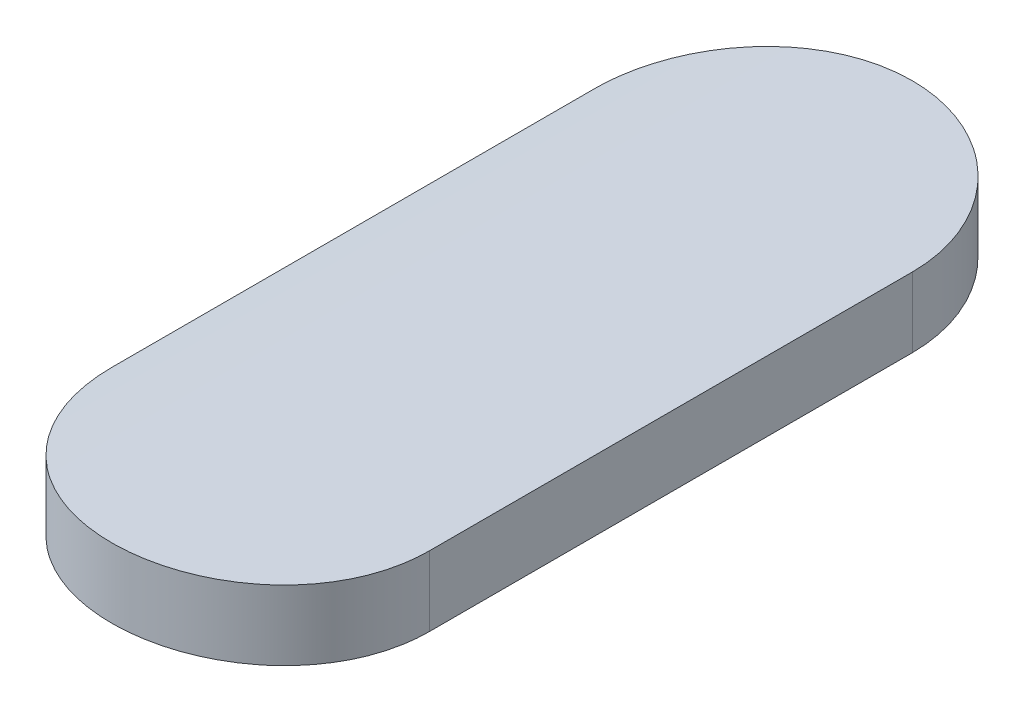
ISO-10303-21;
HEADER;
FILE_DESCRIPTION(('STEP AP214'),'2;1');
FILE_NAME('part.step','',(''),(''),'','','');
FILE_SCHEMA(('AUTOMOTIVE_DESIGN { 1 0 10303 214 1 1 1 1 }'));
ENDSEC;
DATA;
#1=APPLICATION_CONTEXT('core data for automotive mechanical design processes');
#2=APPLICATION_PROTOCOL_DEFINITION('international standard','automotive_design',2000,#1);
#3=PRODUCT_CONTEXT('',#1,'mechanical');
#4=PRODUCT('Part','Part','',(#3));
#5=PRODUCT_RELATED_PRODUCT_CATEGORY('part','',(#4));
#6=PRODUCT_DEFINITION_FORMATION('','',#4);
#7=PRODUCT_DEFINITION_CONTEXT('part definition',#1,'design');
#8=PRODUCT_DEFINITION('design','',#6,#7);
#9=PRODUCT_DEFINITION_SHAPE('','',#8);
#10=(LENGTH_UNIT() NAMED_UNIT(*) SI_UNIT(.MILLI.,.METRE.));
#11=(NAMED_UNIT(*) PLANE_ANGLE_UNIT() SI_UNIT($,.RADIAN.));
#12=(NAMED_UNIT(*) SI_UNIT($,.STERADIAN.) SOLID_ANGLE_UNIT());
#13=UNCERTAINTY_MEASURE_WITH_UNIT(LENGTH_MEASURE(1.E-05),#10,'distance_accuracy_value','');
#14=(GEOMETRIC_REPRESENTATION_CONTEXT(3) GLOBAL_UNCERTAINTY_ASSIGNED_CONTEXT((#13)) GLOBAL_UNIT_ASSIGNED_CONTEXT((#10,
#11,#12)) REPRESENTATION_CONTEXT('',''));
#15=CARTESIAN_POINT('',(0.,0.,0.));
#16=DIRECTION('',(0.,0.,1.));
#17=DIRECTION('',(1.,0.,0.));
#18=AXIS2_PLACEMENT_3D('',#15,#16,#17);
#19=CARTESIAN_POINT('',(-102.183303397109,-58.0021041199526,0.810125243112793));
#20=DIRECTION('',(0.,0.,1.));
#21=DIRECTION('',(1.,0.,0.));
#22=AXIS2_PLACEMENT_3D('',#19,#20,#21);
#23=CYLINDRICAL_SURFACE('',#22,3.03);
#24=DIRECTION('',(0.,0.,-1.));
#25=VECTOR('',#24,1.);
#26=CARTESIAN_POINT('',(-102.456886969413,-54.9844805468465,-0.418890375643386));
#27=LINE('',#26,#25);
#28=CARTESIAN_POINT('',(-102.456886969413,-54.9844805468465,-0.418890375643386));
#29=VERTEX_POINT('',#28);
#30=CARTESIAN_POINT('',(-102.456886969413,-54.9844805468465,-1.25058443544607));
#31=VERTEX_POINT('',#30);
#32=EDGE_CURVE('E63',#29,#31,#27,.T.);
#33=ORIENTED_EDGE('',*,*,#32,.T.);
#34=CARTESIAN_POINT('',(-101.909719824805,-54.9844805468465,-1.25058443544607));
#35=CARTESIAN_POINT('',(-101.909706605658,-54.9844850850065,-1.26594230880644));
#36=CARTESIAN_POINT('',(-101.911012210473,-54.9843634291541,-1.28129556968977));
#37=CARTESIAN_POINT('',(-101.916162756661,-54.9839013638385,-1.31155313436541));
#38=CARTESIAN_POINT('',(-101.920005406143,-54.9835611518201,-1.32645783068304));
#39=CARTESIAN_POINT('',(-101.930134044468,-54.982695325965,-1.35541346846418));
#40=CARTESIAN_POINT('',(-101.936420992914,-54.9821696393207,-1.36946407211287));
#41=CARTESIAN_POINT('',(-101.951253172458,-54.9809936958497,-1.3963090716143));
#42=CARTESIAN_POINT('',(-101.959798099861,-54.9803434557786,-1.40910363608506));
#43=CARTESIAN_POINT('',(-101.978931274905,-54.9789891929714,-1.43311185884462));
#44=CARTESIAN_POINT('',(-101.989524705438,-54.9782850366116,-1.4443213795828));
#45=CARTESIAN_POINT('',(-102.01244423575,-54.976903511139,-1.46480719554307));
#46=CARTESIAN_POINT('',(-102.024770598873,-54.9762261461177,-1.47408319640817));
#47=CARTESIAN_POINT('',(-102.050830830711,-54.9749732653347,-1.49045136433822));
#48=CARTESIAN_POINT('',(-102.064567028138,-54.9743979225072,-1.49753983817727));
#49=CARTESIAN_POINT('',(-102.093039900517,-54.9734154280022,-1.50930772549852));
#50=CARTESIAN_POINT('',(-102.107776494586,-54.9730082627462,-1.51398733347563));
#51=CARTESIAN_POINT('',(-102.137789954603,-54.9724089065577,-1.52079293233044));
#52=CARTESIAN_POINT('',(-102.153065236644,-54.9722161320768,-1.52292585617692));
#53=CARTESIAN_POINT('',(-102.18375848949,-54.9720652956585,-1.52459899115631));
#54=CARTESIAN_POINT('',(-102.199176460722,-54.972107234425,-1.52413919451433));
#55=CARTESIAN_POINT('',(-102.229669558058,-54.9724206277345,-1.52064550122751));
#56=CARTESIAN_POINT('',(-102.244745554765,-54.9726914108666,-1.51761913460157));
#57=CARTESIAN_POINT('',(-102.274174660857,-54.9734312715637,-1.50908994007883));
#58=CARTESIAN_POINT('',(-102.288527765871,-54.9739003503275,-1.50358709721214));
#59=CARTESIAN_POINT('',(-102.316127881446,-54.9749852107613,-1.49025268635527));
#60=CARTESIAN_POINT('',(-102.329373238902,-54.9756012065815,-1.48241771482055));
#61=CARTESIAN_POINT('',(-102.354363137426,-54.9769106737635,-1.46464431848637));
#62=CARTESIAN_POINT('',(-102.366107710778,-54.9776041434581,-1.45470593894639));
#63=CARTESIAN_POINT('',(-102.387805918562,-54.9789935419706,-1.43296688073388));
#64=CARTESIAN_POINT('',(-102.397753257335,-54.9796894710466,-1.42115991733832));
#65=CARTESIAN_POINT('',(-102.41552860711,-54.9810031213351,-1.3960362716264));
#66=CARTESIAN_POINT('',(-102.423355968339,-54.9816208185386,-1.3827191282106));
#67=CARTESIAN_POINT('',(-102.43666961025,-54.9827084570825,-1.35494453696834));
#68=CARTESIAN_POINT('',(-102.44215412786,-54.9831782870781,-1.34048624004393));
#69=CARTESIAN_POINT('',(-102.45060539616,-54.9839144740036,-1.31086648875095));
#70=CARTESIAN_POINT('',(-102.453575961733,-54.9841811391716,-1.29570613675035));
#71=CARTESIAN_POINT('',(-102.45634450532,-54.9844315961996,-1.27050475649965));
#72=CARTESIAN_POINT('',(-102.456891551668,-54.9844819522347,-1.26054212270751));
#73=CARTESIAN_POINT('',(-102.456886969413,-54.9844805468465,-1.25058443544607));
#74=B_SPLINE_CURVE_WITH_KNOTS('',3,(#34,#35,#36,#37,#38,#39,#40,#41,#42,#43,#44,#45,#46,#47,#48,
#49,#50,#51,#52,#53,#54,#55,#56,#57,#58,#59,#60,#61,#62,#63,#64,#65,#66,#67,#68,#69,#70,#71,#72,
#73),.UNSPECIFIED.,.F.,.F.,(4,2,2,2,2,2,2,2,2,2,2,2,2,2,2,2,2,2,2,4),(0.,0.0460110092394254,
0.0919805102672427,0.137968076626718,0.183949460880802,0.230048741249604,0.276155034605764,
0.322338749161009,0.368518734199195,0.4145727123466,0.460626828597775,0.506546292990871,
0.552466034963503,0.598453124267928,0.64443922415896,0.690583414231287,0.736741731520304,
0.782934723603295,0.829057492186304,0.858928716261802),.UNSPECIFIED.);
#75=CARTESIAN_POINT('',(-101.909719824806,-54.9844805468465,-1.25058443544607));
#76=VERTEX_POINT('',#75);
#77=EDGE_CURVE('E21',#76,#31,#74,.T.);
#78=ORIENTED_EDGE('',*,*,#77,.F.);
#79=DIRECTION('',(0.,0.,1.));
#80=VECTOR('',#79,1.);
#81=CARTESIAN_POINT('',(-101.909719824806,-54.9844805468465,-1.25058443544607));
#82=LINE('',#81,#80);
#83=CARTESIAN_POINT('',(-101.909719824806,-54.9844805468465,-0.418890375643386));
#84=VERTEX_POINT('',#83);
#85=EDGE_CURVE('E60',#76,#84,#82,.T.);
#86=ORIENTED_EDGE('',*,*,#85,.T.);
#87=CARTESIAN_POINT('',(-102.456886969413,-54.9844805468465,-0.418890375643386));
#88=CARTESIAN_POINT('',(-102.456900190607,-54.9844850849377,-0.403532552212933));
#89=CARTESIAN_POINT('',(-102.455594593258,-54.9843634299103,-0.388179341133129));
#90=CARTESIAN_POINT('',(-102.450444061444,-54.9839013660614,-0.357921773656045));
#91=CARTESIAN_POINT('',(-102.446601402425,-54.983561153268,-0.343017027551366));
#92=CARTESIAN_POINT('',(-102.436472642403,-54.9826953165674,-0.314061029618398));
#93=CARTESIAN_POINT('',(-102.430185536937,-54.9821696164489,-0.300010131397706));
#94=CARTESIAN_POINT('',(-102.41535324315,-54.9809936677021,-0.273165183244441));
#95=CARTESIAN_POINT('',(-102.406808456113,-54.980343441213,-0.260370910510878));
#96=CARTESIAN_POINT('',(-102.387676631922,-54.9789892694197,-0.236364313803236));
#97=CARTESIAN_POINT('',(-102.377084597454,-54.9782851952686,-0.225155979483312));
#98=CARTESIAN_POINT('',(-102.354165239255,-54.9769036653171,-0.204669706015482));
#99=CARTESIAN_POINT('',(-102.341837261432,-54.9762262196739,-0.195392497784914));
#100=CARTESIAN_POINT('',(-102.315769264304,-54.9749729209117,-0.179019025092981));
#101=CARTESIAN_POINT('',(-102.302026318173,-54.9743972853461,-0.171927407488309));
#102=CARTESIAN_POINT('',(-102.27354921626,-54.9734149909817,-0.16016178696441));
#103=CARTESIAN_POINT('',(-102.258816238366,-54.9730081353731,-0.155484966646577));
#104=CARTESIAN_POINT('',(-102.233886053535,-54.972510035285,-0.149830883428783));
#105=CARTESIAN_POINT('',(-102.223846782162,-54.972358537245,-0.148136700735683));
#106=CARTESIAN_POINT('',(-102.203640939076,-54.9721555261584,-0.145874433100257));
#107=CARTESIAN_POINT('',(-102.193474365172,-54.9721040148336,-0.145306367549251));
#108=CARTESIAN_POINT('',(-102.167968999569,-54.9721042784367,-0.145307460365492));
#109=CARTESIAN_POINT('',(-102.152624613888,-54.9722217636421,-0.146600348966459));
#110=CARTESIAN_POINT('',(-102.122361359423,-54.9726791209169,-0.151738551797835));
#111=CARTESIAN_POINT('',(-102.107442963411,-54.9730192307578,-0.155586595094576));
#112=CARTESIAN_POINT('',(-102.078473534918,-54.9738834186235,-0.165722568118504));
#113=CARTESIAN_POINT('',(-102.064422014796,-54.97440739209,-0.1720091113495));
#114=CARTESIAN_POINT('',(-102.037576476559,-54.9755806299851,-0.186841237701006));
#115=CARTESIAN_POINT('',(-102.024782230313,-54.9762298716205,-0.195386409955503));
#116=CARTESIAN_POINT('',(-102.000774094236,-54.9775829614183,-0.21451998728212));
#117=CARTESIAN_POINT('',(-101.989564399305,-54.9782869471526,-0.225113646368365));
#118=CARTESIAN_POINT('',(-101.969079070535,-54.9796690712488,-0.248033302183883));
#119=CARTESIAN_POINT('',(-101.959803597104,-54.980347207463,-0.260359442448896));
#120=CARTESIAN_POINT('',(-101.943434148177,-54.9816024211497,-0.286421291886513));
#121=CARTESIAN_POINT('',(-101.936344485946,-54.9821792978532,-0.300159717626489));
#122=CARTESIAN_POINT('',(-101.924577378013,-54.9831645823514,-0.328636259658781));
#123=CARTESIAN_POINT('',(-101.919898629531,-54.9835730811081,-0.343373831162475));
#124=CARTESIAN_POINT('',(-101.914242216141,-54.984073110083,-0.368315743955098));
#125=CARTESIAN_POINT('',(-101.91254746587,-54.9842251554516,-0.37836211292653));
#126=CARTESIAN_POINT('',(-101.910286357103,-54.9844291774748,-0.398567675569197));
#127=CARTESIAN_POINT('',(-101.909718414401,-54.9844812946176,-0.408726690618611));
#128=CARTESIAN_POINT('',(-101.909719824805,-54.9844805468465,-0.418890375643388));
#129=B_SPLINE_CURVE_WITH_KNOTS('',3,(#87,#88,#89,#90,#91,#92,#93,#94,#95,#96,#97,#98,#99,#100,
#101,#102,#103,#104,#105,#106,#107,#108,#109,#110,#111,#112,#113,#114,#115,#116,#117,#118,#119,
#120,#121,#122,#123,#124,#125,#126,#127,#128),.UNSPECIFIED.,.F.,.F.,(4,2,2,2,2,2,2,2,2,2,2,2,2,
2,2,2,2,2,2,2,4),(0.,0.0460108603236396,0.0919805102691056,0.137969069867937,0.183949460872781,
0.230043540383735,0.27615503457662,0.32236390216454,0.368518734300648,0.39900650752063,
0.429494805724201,0.475460900795541,0.521476169693522,0.567465313228819,0.613446096654045,
0.659546415719329,0.705650556441166,0.751845100716589,0.798014656700611,0.828523596054447,
0.858989611669695),.UNSPECIFIED.);
#130=EDGE_CURVE('E77',#29,#84,#129,.T.);
#131=ORIENTED_EDGE('',*,*,#130,.F.);
#132=EDGE_LOOP('',(#33,#78,#86,#131));
#133=FACE_BOUND('',#132,.T.);
#134=ADVANCED_FACE('F17',(#133),#23,.F.);
#135=CARTESIAN_POINT('',(-102.183303397109,-53.4571041199525,-1.25058443544607));
#136=DIRECTION('',(0.,1.,0.));
#137=DIRECTION('',(0.,0.,1.));
#138=AXIS2_PLACEMENT_3D('',#135,#136,#137);
#139=CYLINDRICAL_SURFACE('',#138,0.273583572303522);
#140=DIRECTION('',(0.,1.,0.));
#141=VECTOR('',#140,1.);
#142=CARTESIAN_POINT('',(-101.909719824806,-53.4571041199525,-1.25058443544607));
#143=LINE('',#142,#141);
#144=CARTESIAN_POINT('',(-101.909719824806,-54.8640072398411,-1.25058443544607));
#145=VERTEX_POINT('',#144);
#146=EDGE_CURVE('E67',#145,#76,#143,.F.);
#147=ORIENTED_EDGE('',*,*,#146,.T.);
#148=ORIENTED_EDGE('',*,*,#77,.T.);
#149=DIRECTION('',(0.,1.,0.));
#150=VECTOR('',#149,1.);
#151=CARTESIAN_POINT('',(-102.456886969413,-53.4571041199525,-1.25058443544607));
#152=LINE('',#151,#150);
#153=CARTESIAN_POINT('',(-102.456886969413,-54.8640072398411,-1.25058443544607));
#154=VERTEX_POINT('',#153);
#155=EDGE_CURVE('E83',#31,#154,#152,.T.);
#156=ORIENTED_EDGE('',*,*,#155,.T.);
#157=CARTESIAN_POINT('',(-101.909719824805,-54.8640072398411,-1.25058443544607));
#158=CARTESIAN_POINT('',(-101.909706616778,-54.8640116038495,-1.26594478271644));
#159=CARTESIAN_POINT('',(-101.911012629097,-54.8638945821352,-1.28130057070052));
#160=CARTESIAN_POINT('',(-101.91616493209,-54.8634501023721,-1.31156339478972));
#161=CARTESIAN_POINT('',(-101.92000896244,-54.8631228315755,-1.3264708178627));
#162=CARTESIAN_POINT('',(-101.930141476108,-54.8622899162493,-1.35543188296314));
#163=CARTESIAN_POINT('',(-101.936430932495,-54.8617842007215,-1.36948518254575));
#164=CARTESIAN_POINT('',(-101.951269236735,-54.8606529156442,-1.39633502259704));
#165=CARTESIAN_POINT('',(-101.959817770308,-54.8600273627696,-1.40913173754066));
#166=CARTESIAN_POINT('',(-101.978957254186,-54.858724650616,-1.43314102137832));
#167=CARTESIAN_POINT('',(-101.989553004558,-54.85804737236,-1.44434975776107));
#168=CARTESIAN_POINT('',(-102.012477047229,-54.8567186189181,-1.46483343030569));
#169=CARTESIAN_POINT('',(-102.024805602851,-54.8560671476734,-1.47410807202307));
#170=CARTESIAN_POINT('',(-102.050868037135,-54.8548623045616,-1.49047183073304));
#171=CARTESIAN_POINT('',(-102.064604063545,-54.854309086249,-1.49755753931129));
#172=CARTESIAN_POINT('',(-102.093075660351,-54.8533644337177,-1.50932010491488));
#173=CARTESIAN_POINT('',(-102.107811151204,-54.8529729866417,-1.51399715338457));
#174=CARTESIAN_POINT('',(-102.13782470229,-54.8523967862496,-1.52079885058031));
#175=CARTESIAN_POINT('',(-102.153101299041,-54.8522115136778,-1.52292991244132));
#176=CARTESIAN_POINT('',(-102.1837967687,-54.8520667749048,-1.52459898234392));
#177=CARTESIAN_POINT('',(-102.199215642245,-54.8521073097163,-1.52413697875463));
#178=CARTESIAN_POINT('',(-102.229713640967,-54.8524091989506,-1.52063817722405));
#179=CARTESIAN_POINT('',(-102.244793572653,-54.8526699554928,-1.51760835059442));
#180=CARTESIAN_POINT('',(-102.274229971334,-54.8533822737681,-1.50907076618021));
#181=CARTESIAN_POINT('',(-102.288586434427,-54.8538338365303,-1.50356299503172));
#182=CARTESIAN_POINT('',(-102.31619086392,-54.8548780121511,-1.49021799056072));
#183=CARTESIAN_POINT('',(-102.3294372941,-54.8554708162598,-1.48237759509875));
#184=CARTESIAN_POINT('',(-102.354428176498,-54.8567308333417,-1.46459259521596));
#185=CARTESIAN_POINT('',(-102.366172664124,-54.8573980445601,-1.45464804041298));
#186=CARTESIAN_POINT('',(-102.387866258427,-54.8587344683245,-1.43289918453586));
#187=CARTESIAN_POINT('',(-102.397809554026,-54.8594036805078,-1.4210890863643));
#188=CARTESIAN_POINT('',(-102.415576264114,-54.8606667104951,-1.39596012249329));
#189=CARTESIAN_POINT('',(-102.423399026913,-54.8612605050917,-1.38264079475134));
#190=CARTESIAN_POINT('',(-102.436703008999,-54.8623058530949,-1.35486328492659));
#191=CARTESIAN_POINT('',(-102.442182501874,-54.8627573015633,-1.34040427243347));
#192=CARTESIAN_POINT('',(-102.450623831935,-54.863464474176,-1.31078436642828));
#193=CARTESIAN_POINT('',(-102.453589485952,-54.8637204949845,-1.29562457397317));
#194=CARTESIAN_POINT('',(-102.456347444913,-54.8639604241394,-1.27045076145606));
#195=CARTESIAN_POINT('',(-102.456891513284,-54.8640085803269,-1.26051511984833));
#196=CARTESIAN_POINT('',(-102.456886969413,-54.8640072398411,-1.25058443544607));
#197=B_SPLINE_CURVE_WITH_KNOTS('',3,(#157,#158,#159,#160,#161,#162,#163,#164,#165,#166,#167,
#168,#169,#170,#171,#172,#173,#174,#175,#176,#177,#178,#179,#180,#181,#182,#183,#184,#185,#186,
#187,#188,#189,#190,#191,#192,#193,#194,#195,#196),.UNSPECIFIED.,.F.,.F.,(4,2,2,2,2,2,2,2,2,2,2,
2,2,2,2,2,2,2,2,4),(0.,0.046018526994018,0.0919961256717346,0.137992038231912,0.183981555270105,
0.230080241017504,0.276185939663917,0.322363072340193,0.368536534213797,0.414593441972155,
0.460650556313085,0.506583030539249,0.552515752488997,0.598511027446195,0.644505217917076,
0.690645251790533,0.736799449546967,0.782987593228124,0.829105481902434,0.858895844339731),.UNSPECIFIED.);
#198=EDGE_CURVE('E70',#145,#154,#197,.T.);
#199=ORIENTED_EDGE('',*,*,#198,.F.);
#200=EDGE_LOOP('',(#147,#148,#156,#199));
#201=FACE_BOUND('',#200,.T.);
#202=ADVANCED_FACE('F68',(#201),#139,.T.);
#203=CARTESIAN_POINT('',(-102.456886969413,-53.4571041199525,-0.418890375643386));
#204=DIRECTION('',(1.,0.,0.));
#205=DIRECTION('',(0.,0.,-1.));
#206=AXIS2_PLACEMENT_3D('',#203,#204,#205);
#207=PLANE('',#206);
#208=DIRECTION('',(0.,0.,1.));
#209=VECTOR('',#208,1.);
#210=CARTESIAN_POINT('',(-102.456886969413,-54.8640072398411,0.810125243112793));
#211=LINE('',#210,#209);
#212=CARTESIAN_POINT('',(-102.456886969413,-54.8640072398411,-0.418890375643386));
#213=VERTEX_POINT('',#212);
#214=EDGE_CURVE('E92',#154,#213,#211,.T.);
#215=ORIENTED_EDGE('',*,*,#214,.F.);
#216=ORIENTED_EDGE('',*,*,#155,.F.);
#217=ORIENTED_EDGE('',*,*,#32,.F.);
#218=DIRECTION('',(0.,1.,0.));
#219=VECTOR('',#218,1.);
#220=CARTESIAN_POINT('',(-102.456886969413,-53.4571041199525,-0.418890375643386));
#221=LINE('',#220,#219);
#222=EDGE_CURVE('E80',#213,#29,#221,.F.);
#223=ORIENTED_EDGE('',*,*,#222,.F.);
#224=EDGE_LOOP('',(#215,#216,#217,#223));
#225=FACE_BOUND('',#224,.T.);
#226=ADVANCED_FACE('F103',(#225),#207,.F.);
#227=CARTESIAN_POINT('',(-102.183303397109,-53.4571041199525,-0.418890375643386));
#228=DIRECTION('',(0.,1.,0.));
#229=DIRECTION('',(0.,0.,1.));
#230=AXIS2_PLACEMENT_3D('',#227,#228,#229);
#231=CYLINDRICAL_SURFACE('',#230,0.273583572303515);
#232=DIRECTION('',(0.,1.,0.));
#233=VECTOR('',#232,1.);
#234=CARTESIAN_POINT('',(-101.909719824806,-53.4571041199525,-0.418890375643386));
#235=LINE('',#234,#233);
#236=CARTESIAN_POINT('',(-101.909719824806,-54.8640072398411,-0.418890375643386));
#237=VERTEX_POINT('',#236);
#238=EDGE_CURVE('E73',#84,#237,#235,.T.);
#239=ORIENTED_EDGE('',*,*,#238,.T.);
#240=CARTESIAN_POINT('',(-102.456886969413,-54.8640072398411,-0.418890375643386));
#241=CARTESIAN_POINT('',(-102.456900179489,-54.8640116037829,-0.403530078771605));
#242=CARTESIAN_POINT('',(-102.455594174716,-54.8638945828694,-0.388174341058224));
#243=CARTESIAN_POINT('',(-102.450441886252,-54.86345010453,-0.357911514141355));
#244=CARTESIAN_POINT('',(-102.446597846284,-54.8631228329808,-0.343004040813818));
#245=CARTESIAN_POINT('',(-102.436465210489,-54.8622899071895,-0.314042614390904));
#246=CARTESIAN_POINT('',(-102.430175596673,-54.8617841786715,-0.299989019549287));
#247=CARTESIAN_POINT('',(-102.415337177917,-54.8606528885075,-0.273139230980292));
#248=CARTESIAN_POINT('',(-102.406788785105,-54.8600273487274,-0.260342808458379));
#249=CARTESIAN_POINT('',(-102.38765065439,-54.8587247242468,-0.236335153048577));
#250=CARTESIAN_POINT('',(-102.377056302192,-54.8580475251671,-0.225127604579873));
#251=CARTESIAN_POINT('',(-102.354132431993,-54.8567187674053,-0.204643473796036));
#252=CARTESIAN_POINT('',(-102.341802259417,-54.8560672185151,-0.195367623208403));
#253=CARTESIAN_POINT('',(-102.315732052178,-54.8548619730904,-0.178998556591857));
#254=CARTESIAN_POINT('',(-102.301989271481,-54.8543084730681,-0.171909703186659));
#255=CARTESIAN_POINT('',(-102.273513443909,-54.853364013255,-0.160149406131124));
#256=CARTESIAN_POINT('',(-102.258781573432,-54.8529728642116,-0.155475146221719));
#257=CARTESIAN_POINT('',(-102.2338580441,-54.8524941369114,-0.149825830236814));
#258=CARTESIAN_POINT('',(-102.223824202065,-54.8523485718543,-0.148133533833658));
#259=CARTESIAN_POINT('',(-102.203629505257,-54.8521535119536,-0.145873792851279));
#260=CARTESIAN_POINT('',(-102.193468648264,-54.8521040187922,-0.145306367969359));
#261=CARTESIAN_POINT('',(-102.16796643803,-54.8521042725794,-0.145307460207253));
#262=CARTESIAN_POINT('',(-102.152619476227,-54.8522173200861,-0.146600775441735));
#263=CARTESIAN_POINT('',(-102.122351022129,-54.8526574002586,-0.151740753874226));
#264=CARTESIAN_POINT('',(-102.107430003153,-54.852984661991,-0.155590150441056));
#265=CARTESIAN_POINT('',(-102.078455291,-54.8538161955517,-0.165729930778515));
#266=CARTESIAN_POINT('',(-102.064401118331,-54.8543203684713,-0.172018950794233));
#267=CARTESIAN_POINT('',(-102.03755077825,-54.855449232041,-0.186857144754768));
#268=CARTESIAN_POINT('',(-102.02475438013,-54.8560739005266,-0.195405903140214));
#269=CARTESIAN_POINT('',(-102.000745145557,-54.8573755748558,-0.214545773806812));
#270=CARTESIAN_POINT('',(-101.989536202558,-54.8580527032867,-0.225141761850879));
#271=CARTESIAN_POINT('',(-101.969052960131,-54.8593819911154,-0.248065956292792));
#272=CARTESIAN_POINT('',(-101.959778820157,-54.8600341484516,-0.260394305320696));
#273=CARTESIAN_POINT('',(-101.943413755972,-54.8612410770389,-0.286458365998949));
#274=CARTESIAN_POINT('',(-101.936326854895,-54.8617956680339,-0.300196609864991));
#275=CARTESIAN_POINT('',(-101.924565054023,-54.8627427988405,-0.328671865001971));
#276=CARTESIAN_POINT('',(-101.919888856196,-54.8631354258381,-0.343408333936013));
#277=CARTESIAN_POINT('',(-101.914237180344,-54.8636158769288,-0.368343649454978));
#278=CARTESIAN_POINT('',(-101.912544302614,-54.8637619262361,-0.378384645101069));
#279=CARTESIAN_POINT('',(-101.910285719424,-54.8639578981373,-0.398579118667912));
#280=CARTESIAN_POINT('',(-101.909718424203,-54.8640079563048,-0.408732417547632));
#281=CARTESIAN_POINT('',(-101.909719824805,-54.8640072398411,-0.418890375643387));
#282=B_SPLINE_CURVE_WITH_KNOTS('',3,(#240,#241,#242,#243,#244,#245,#246,#247,#248,#249,#250,
#251,#252,#253,#254,#255,#256,#257,#258,#259,#260,#261,#262,#263,#264,#265,#266,#267,#268,#269,
#270,#271,#272,#273,#274,#275,#276,#277,#278,#279,#280,#281),.UNSPECIFIED.,.F.,.F.,(4,2,2,2,2,2,
2,2,2,2,2,2,2,2,2,2,2,2,2,2,4),(0.,0.0460183766811845,0.0919961256735281,0.13799303377237,
0.183981555262621,0.230075033156856,0.276185939636104,0.322388242159422,0.368536534298572,
0.399007184528179,0.42947836831593,0.475452175727004,0.521475224990693,0.56747258425544,
0.61346149061606,0.659561307046478,0.705664921228216,0.751852838301505,0.798015859631056,
0.828507846884666,0.858956736830119),.UNSPECIFIED.);
#283=EDGE_CURVE('E30',#213,#237,#282,.T.);
#284=ORIENTED_EDGE('',*,*,#283,.F.);
#285=ORIENTED_EDGE('',*,*,#222,.T.);
#286=ORIENTED_EDGE('',*,*,#130,.T.);
#287=EDGE_LOOP('',(#239,#284,#285,#286));
#288=FACE_BOUND('',#287,.T.);
#289=ADVANCED_FACE('F99',(#288),#231,.T.);
#290=CARTESIAN_POINT('',(-101.909719824806,-53.4571041199525,-1.25058443544607));
#291=DIRECTION('',(-1.,0.,0.));
#292=DIRECTION('',(0.,0.,1.));
#293=AXIS2_PLACEMENT_3D('',#290,#291,#292);
#294=PLANE('',#293);
#295=DIRECTION('',(0.,0.,1.));
#296=VECTOR('',#295,1.);
#297=CARTESIAN_POINT('',(-101.909719824806,-54.8640072398411,0.810125243112793));
#298=LINE('',#297,#296);
#299=EDGE_CURVE('E11',#237,#145,#298,.F.);
#300=ORIENTED_EDGE('',*,*,#299,.F.);
#301=ORIENTED_EDGE('',*,*,#238,.F.);
#302=ORIENTED_EDGE('',*,*,#85,.F.);
#303=ORIENTED_EDGE('',*,*,#146,.F.);
#304=EDGE_LOOP('',(#300,#301,#302,#303));
#305=FACE_BOUND('',#304,.T.);
#306=ADVANCED_FACE('F76',(#305),#294,.F.);
#307=CARTESIAN_POINT('',(-102.183303397109,-58.0021041199526,0.810125243112793));
#308=DIRECTION('',(0.,0.,1.));
#309=DIRECTION('',(1.,0.,0.));
#310=AXIS2_PLACEMENT_3D('',#307,#308,#309);
#311=CYLINDRICAL_SURFACE('',#310,3.15);
#312=ORIENTED_EDGE('',*,*,#283,.T.);
#313=ORIENTED_EDGE('',*,*,#299,.T.);
#314=ORIENTED_EDGE('',*,*,#198,.T.);
#315=ORIENTED_EDGE('',*,*,#214,.T.);
#316=EDGE_LOOP('',(#312,#313,#314,#315));
#317=FACE_BOUND('',#316,.T.);
#318=ADVANCED_FACE('F96',(#317),#311,.T.);
#319=CLOSED_SHELL('',(#134,#202,#226,#289,#306,#318));
#320=MANIFOLD_SOLID_BREP('B1',#319);
#321=ADVANCED_BREP_SHAPE_REPRESENTATION('',(#18,#320),#14);
#322=SHAPE_DEFINITION_REPRESENTATION(#9,#321);
ENDSEC;
END-ISO-10303-21;
